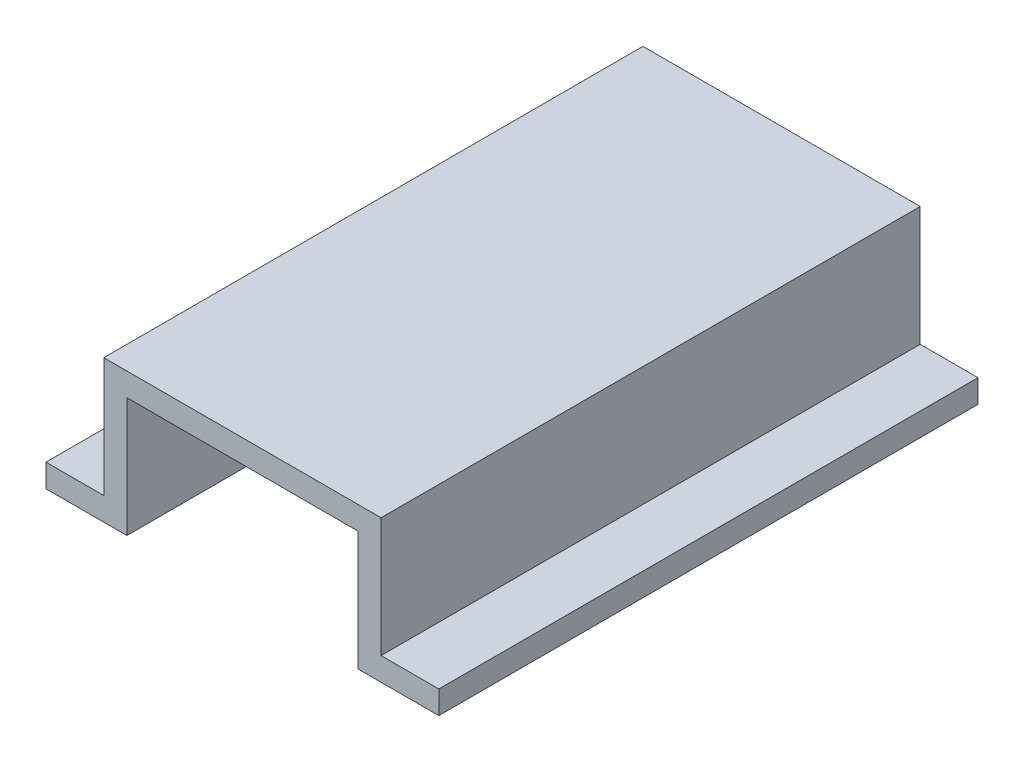
ISO-10303-21;
HEADER;
FILE_DESCRIPTION(('STEP AP214'),'2;1');
FILE_NAME('part.step','',(''),(''),'','','');
FILE_SCHEMA(('AUTOMOTIVE_DESIGN { 1 0 10303 214 1 1 1 1 }'));
ENDSEC;
DATA;
#1=APPLICATION_CONTEXT('core data for automotive mechanical design processes');
#2=APPLICATION_PROTOCOL_DEFINITION('international standard','automotive_design',2000,#1);
#3=PRODUCT_CONTEXT('',#1,'mechanical');
#4=PRODUCT('Part','Part','',(#3));
#5=PRODUCT_RELATED_PRODUCT_CATEGORY('part','',(#4));
#6=PRODUCT_DEFINITION_FORMATION('','',#4);
#7=PRODUCT_DEFINITION_CONTEXT('part definition',#1,'design');
#8=PRODUCT_DEFINITION('design','',#6,#7);
#9=PRODUCT_DEFINITION_SHAPE('','',#8);
#10=(LENGTH_UNIT() NAMED_UNIT(*) SI_UNIT(.MILLI.,.METRE.));
#11=(NAMED_UNIT(*) PLANE_ANGLE_UNIT() SI_UNIT($,.RADIAN.));
#12=(NAMED_UNIT(*) SI_UNIT($,.STERADIAN.) SOLID_ANGLE_UNIT());
#13=UNCERTAINTY_MEASURE_WITH_UNIT(LENGTH_MEASURE(1.E-05),#10,'distance_accuracy_value','');
#14=(GEOMETRIC_REPRESENTATION_CONTEXT(3) GLOBAL_UNCERTAINTY_ASSIGNED_CONTEXT((#13)) GLOBAL_UNIT_ASSIGNED_CONTEXT((#10,
#11,#12)) REPRESENTATION_CONTEXT('',''));
#15=CARTESIAN_POINT('',(0.,0.,0.));
#16=DIRECTION('',(0.,0.,1.));
#17=DIRECTION('',(1.,0.,0.));
#18=AXIS2_PLACEMENT_3D('',#15,#16,#17);
#19=CARTESIAN_POINT('',(0.,-6.,140.));
#20=DIRECTION('',(1.,0.,0.));
#21=DIRECTION('',(0.,0.,-1.));
#22=AXIS2_PLACEMENT_3D('',#19,#20,#21);
#23=PLANE('',#22);
#24=DIRECTION('',(0.,-1.,0.));
#25=VECTOR('',#24,1.);
#26=CARTESIAN_POINT('',(0.,-6.,0.));
#27=LINE('',#26,#25);
#28=CARTESIAN_POINT('',(0.,0.,0.));
#29=VERTEX_POINT('',#28);
#30=CARTESIAN_POINT('',(0.,-6.,0.));
#31=VERTEX_POINT('',#30);
#32=EDGE_CURVE('E156',#29,#31,#27,.T.);
#33=ORIENTED_EDGE('',*,*,#32,.T.);
#34=DIRECTION('',(0.,0.,-1.));
#35=VECTOR('',#34,1.);
#36=CARTESIAN_POINT('',(0.,-6.,140.));
#37=LINE('',#36,#35);
#38=CARTESIAN_POINT('',(0.,-6.,140.));
#39=VERTEX_POINT('',#38);
#40=EDGE_CURVE('E11',#39,#31,#37,.T.);
#41=ORIENTED_EDGE('',*,*,#40,.F.);
#42=DIRECTION('',(0.,-1.,0.));
#43=VECTOR('',#42,1.);
#44=CARTESIAN_POINT('',(0.,-6.,140.));
#45=LINE('',#44,#43);
#46=CARTESIAN_POINT('',(0.,0.,140.));
#47=VERTEX_POINT('',#46);
#48=EDGE_CURVE('E178',#47,#39,#45,.T.);
#49=ORIENTED_EDGE('',*,*,#48,.F.);
#50=DIRECTION('',(0.,0.,-1.));
#51=VECTOR('',#50,1.);
#52=CARTESIAN_POINT('',(0.,0.,140.));
#53=LINE('',#52,#51);
#54=EDGE_CURVE('E152',#47,#29,#53,.T.);
#55=ORIENTED_EDGE('',*,*,#54,.T.);
#56=EDGE_LOOP('',(#33,#41,#49,#55));
#57=FACE_BOUND('',#56,.T.);
#58=ADVANCED_FACE('F36',(#57),#23,.F.);
#59=CARTESIAN_POINT('',(21.,-6.,140.));
#60=DIRECTION('',(0.,1.,0.));
#61=DIRECTION('',(-1.,0.,0.));
#62=AXIS2_PLACEMENT_3D('',#59,#60,#61);
#63=PLANE('',#62);
#64=DIRECTION('',(1.,0.,0.));
#65=VECTOR('',#64,1.);
#66=CARTESIAN_POINT('',(21.,-6.,0.));
#67=LINE('',#66,#65);
#68=CARTESIAN_POINT('',(21.,-6.,0.));
#69=VERTEX_POINT('',#68);
#70=EDGE_CURVE('E159',#31,#69,#67,.T.);
#71=ORIENTED_EDGE('',*,*,#70,.T.);
#72=DIRECTION('',(0.,0.,-1.));
#73=VECTOR('',#72,1.);
#74=CARTESIAN_POINT('',(21.,-6.,140.));
#75=LINE('',#74,#73);
#76=CARTESIAN_POINT('',(21.,-6.,140.));
#77=VERTEX_POINT('',#76);
#78=EDGE_CURVE('E44',#77,#69,#75,.T.);
#79=ORIENTED_EDGE('',*,*,#78,.F.);
#80=DIRECTION('',(1.,0.,0.));
#81=VECTOR('',#80,1.);
#82=CARTESIAN_POINT('',(21.,-6.,140.));
#83=LINE('',#82,#81);
#84=EDGE_CURVE('E107',#39,#77,#83,.T.);
#85=ORIENTED_EDGE('',*,*,#84,.F.);
#86=ORIENTED_EDGE('',*,*,#40,.T.);
#87=EDGE_LOOP('',(#71,#79,#85,#86));
#88=FACE_BOUND('',#87,.T.);
#89=ADVANCED_FACE('F256',(#88),#63,.F.);
#90=CARTESIAN_POINT('',(21.,25.,140.));
#91=DIRECTION('',(-1.,0.,0.));
#92=DIRECTION('',(0.,-1.,0.));
#93=AXIS2_PLACEMENT_3D('',#90,#91,#92);
#94=PLANE('',#93);
#95=DIRECTION('',(0.,1.,0.));
#96=VECTOR('',#95,1.);
#97=CARTESIAN_POINT('',(21.,25.,0.));
#98=LINE('',#97,#96);
#99=CARTESIAN_POINT('',(21.,25.,0.));
#100=VERTEX_POINT('',#99);
#101=EDGE_CURVE('E161',#69,#100,#98,.T.);
#102=ORIENTED_EDGE('',*,*,#101,.T.);
#103=DIRECTION('',(0.,0.,-1.));
#104=VECTOR('',#103,1.);
#105=CARTESIAN_POINT('',(21.,25.,140.));
#106=LINE('',#105,#104);
#107=CARTESIAN_POINT('',(21.,25.,140.));
#108=VERTEX_POINT('',#107);
#109=EDGE_CURVE('E197',#108,#100,#106,.T.);
#110=ORIENTED_EDGE('',*,*,#109,.F.);
#111=DIRECTION('',(0.,1.,0.));
#112=VECTOR('',#111,1.);
#113=CARTESIAN_POINT('',(21.,25.,140.));
#114=LINE('',#113,#112);
#115=EDGE_CURVE('E205',#77,#108,#114,.T.);
#116=ORIENTED_EDGE('',*,*,#115,.F.);
#117=ORIENTED_EDGE('',*,*,#78,.T.);
#118=EDGE_LOOP('',(#102,#110,#116,#117));
#119=FACE_BOUND('',#118,.T.);
#120=ADVANCED_FACE('F203',(#119),#94,.F.);
#121=CARTESIAN_POINT('',(81.,25.,140.));
#122=DIRECTION('',(0.,1.,0.));
#123=DIRECTION('',(-1.,0.,0.));
#124=AXIS2_PLACEMENT_3D('',#121,#122,#123);
#125=PLANE('',#124);
#126=DIRECTION('',(1.,0.,0.));
#127=VECTOR('',#126,1.);
#128=CARTESIAN_POINT('',(81.,25.,0.));
#129=LINE('',#128,#127);
#130=CARTESIAN_POINT('',(81.,25.,0.));
#131=VERTEX_POINT('',#130);
#132=EDGE_CURVE('E163',#100,#131,#129,.T.);
#133=ORIENTED_EDGE('',*,*,#132,.T.);
#134=DIRECTION('',(0.,0.,-1.));
#135=VECTOR('',#134,1.);
#136=CARTESIAN_POINT('',(81.,25.,140.));
#137=LINE('',#136,#135);
#138=CARTESIAN_POINT('',(81.,25.,140.));
#139=VERTEX_POINT('',#138);
#140=EDGE_CURVE('E194',#139,#131,#137,.T.);
#141=ORIENTED_EDGE('',*,*,#140,.F.);
#142=DIRECTION('',(1.,0.,0.));
#143=VECTOR('',#142,1.);
#144=CARTESIAN_POINT('',(81.,25.,140.));
#145=LINE('',#144,#143);
#146=EDGE_CURVE('E223',#108,#139,#145,.T.);
#147=ORIENTED_EDGE('',*,*,#146,.F.);
#148=ORIENTED_EDGE('',*,*,#109,.T.);
#149=EDGE_LOOP('',(#133,#141,#147,#148));
#150=FACE_BOUND('',#149,.T.);
#151=ADVANCED_FACE('F214',(#150),#125,.F.);
#152=CARTESIAN_POINT('',(81.,-6.,140.));
#153=DIRECTION('',(1.,0.,0.));
#154=DIRECTION('',(0.,1.,0.));
#155=AXIS2_PLACEMENT_3D('',#152,#153,#154);
#156=PLANE('',#155);
#157=DIRECTION('',(0.,-1.,0.));
#158=VECTOR('',#157,1.);
#159=CARTESIAN_POINT('',(81.,-6.,0.));
#160=LINE('',#159,#158);
#161=CARTESIAN_POINT('',(81.,-6.,0.));
#162=VERTEX_POINT('',#161);
#163=EDGE_CURVE('E165',#131,#162,#160,.T.);
#164=ORIENTED_EDGE('',*,*,#163,.T.);
#165=DIRECTION('',(0.,0.,-1.));
#166=VECTOR('',#165,1.);
#167=CARTESIAN_POINT('',(81.,-6.,140.));
#168=LINE('',#167,#166);
#169=CARTESIAN_POINT('',(81.,-6.,140.));
#170=VERTEX_POINT('',#169);
#171=EDGE_CURVE('E191',#170,#162,#168,.T.);
#172=ORIENTED_EDGE('',*,*,#171,.F.);
#173=DIRECTION('',(0.,-1.,0.));
#174=VECTOR('',#173,1.);
#175=CARTESIAN_POINT('',(81.,-6.,140.));
#176=LINE('',#175,#174);
#177=EDGE_CURVE('E220',#139,#170,#176,.T.);
#178=ORIENTED_EDGE('',*,*,#177,.F.);
#179=ORIENTED_EDGE('',*,*,#140,.T.);
#180=EDGE_LOOP('',(#164,#172,#178,#179));
#181=FACE_BOUND('',#180,.T.);
#182=ADVANCED_FACE('F218',(#181),#156,.F.);
#183=CARTESIAN_POINT('',(102.,-6.,140.));
#184=DIRECTION('',(0.,1.,0.));
#185=DIRECTION('',(-1.,0.,0.));
#186=AXIS2_PLACEMENT_3D('',#183,#184,#185);
#187=PLANE('',#186);
#188=DIRECTION('',(1.,0.,0.));
#189=VECTOR('',#188,1.);
#190=CARTESIAN_POINT('',(102.,-6.,0.));
#191=LINE('',#190,#189);
#192=CARTESIAN_POINT('',(102.,-6.,0.));
#193=VERTEX_POINT('',#192);
#194=EDGE_CURVE('E167',#162,#193,#191,.T.);
#195=ORIENTED_EDGE('',*,*,#194,.T.);
#196=DIRECTION('',(0.,0.,-1.));
#197=VECTOR('',#196,1.);
#198=CARTESIAN_POINT('',(102.,-6.,140.));
#199=LINE('',#198,#197);
#200=CARTESIAN_POINT('',(102.,-6.,140.));
#201=VERTEX_POINT('',#200);
#202=EDGE_CURVE('E188',#201,#193,#199,.T.);
#203=ORIENTED_EDGE('',*,*,#202,.F.);
#204=DIRECTION('',(1.,0.,0.));
#205=VECTOR('',#204,1.);
#206=CARTESIAN_POINT('',(102.,-6.,140.));
#207=LINE('',#206,#205);
#208=EDGE_CURVE('E222',#170,#201,#207,.T.);
#209=ORIENTED_EDGE('',*,*,#208,.F.);
#210=ORIENTED_EDGE('',*,*,#171,.T.);
#211=EDGE_LOOP('',(#195,#203,#209,#210));
#212=FACE_BOUND('',#211,.T.);
#213=ADVANCED_FACE('F269',(#212),#187,.F.);
#214=CARTESIAN_POINT('',(102.,0.,140.));
#215=DIRECTION('',(-1.,0.,0.));
#216=DIRECTION('',(0.,0.,1.));
#217=AXIS2_PLACEMENT_3D('',#214,#215,#216);
#218=PLANE('',#217);
#219=DIRECTION('',(0.,1.,0.));
#220=VECTOR('',#219,1.);
#221=CARTESIAN_POINT('',(102.,0.,0.));
#222=LINE('',#221,#220);
#223=CARTESIAN_POINT('',(102.,0.,0.));
#224=VERTEX_POINT('',#223);
#225=EDGE_CURVE('E169',#193,#224,#222,.T.);
#226=ORIENTED_EDGE('',*,*,#225,.T.);
#227=DIRECTION('',(0.,0.,-1.));
#228=VECTOR('',#227,1.);
#229=CARTESIAN_POINT('',(102.,0.,140.));
#230=LINE('',#229,#228);
#231=CARTESIAN_POINT('',(102.,0.,140.));
#232=VERTEX_POINT('',#231);
#233=EDGE_CURVE('E185',#232,#224,#230,.T.);
#234=ORIENTED_EDGE('',*,*,#233,.F.);
#235=DIRECTION('',(0.,1.,0.));
#236=VECTOR('',#235,1.);
#237=CARTESIAN_POINT('',(102.,0.,140.));
#238=LINE('',#237,#236);
#239=EDGE_CURVE('E225',#201,#232,#238,.T.);
#240=ORIENTED_EDGE('',*,*,#239,.F.);
#241=ORIENTED_EDGE('',*,*,#202,.T.);
#242=EDGE_LOOP('',(#226,#234,#240,#241));
#243=FACE_BOUND('',#242,.T.);
#244=ADVANCED_FACE('F272',(#243),#218,.F.);
#245=CARTESIAN_POINT('',(87.,0.,140.));
#246=DIRECTION('',(0.,-1.,0.));
#247=DIRECTION('',(1.,0.,0.));
#248=AXIS2_PLACEMENT_3D('',#245,#246,#247);
#249=PLANE('',#248);
#250=DIRECTION('',(-1.,0.,0.));
#251=VECTOR('',#250,1.);
#252=CARTESIAN_POINT('',(87.,0.,0.));
#253=LINE('',#252,#251);
#254=CARTESIAN_POINT('',(87.,0.,0.));
#255=VERTEX_POINT('',#254);
#256=EDGE_CURVE('E171',#224,#255,#253,.T.);
#257=ORIENTED_EDGE('',*,*,#256,.T.);
#258=DIRECTION('',(0.,0.,-1.));
#259=VECTOR('',#258,1.);
#260=CARTESIAN_POINT('',(87.,0.,140.));
#261=LINE('',#260,#259);
#262=CARTESIAN_POINT('',(87.,0.,140.));
#263=VERTEX_POINT('',#262);
#264=EDGE_CURVE('E182',#263,#255,#261,.T.);
#265=ORIENTED_EDGE('',*,*,#264,.F.);
#266=DIRECTION('',(-1.,0.,0.));
#267=VECTOR('',#266,1.);
#268=CARTESIAN_POINT('',(87.,0.,140.));
#269=LINE('',#268,#267);
#270=EDGE_CURVE('E231',#232,#263,#269,.T.);
#271=ORIENTED_EDGE('',*,*,#270,.F.);
#272=ORIENTED_EDGE('',*,*,#233,.T.);
#273=EDGE_LOOP('',(#257,#265,#271,#272));
#274=FACE_BOUND('',#273,.T.);
#275=ADVANCED_FACE('F237',(#274),#249,.F.);
#276=CARTESIAN_POINT('',(87.,31.,140.));
#277=DIRECTION('',(-1.,0.,0.));
#278=DIRECTION('',(0.,0.,1.));
#279=AXIS2_PLACEMENT_3D('',#276,#277,#278);
#280=PLANE('',#279);
#281=DIRECTION('',(0.,1.,0.));
#282=VECTOR('',#281,1.);
#283=CARTESIAN_POINT('',(87.,31.,0.));
#284=LINE('',#283,#282);
#285=CARTESIAN_POINT('',(87.,31.,0.));
#286=VERTEX_POINT('',#285);
#287=EDGE_CURVE('E173',#255,#286,#284,.T.);
#288=ORIENTED_EDGE('',*,*,#287,.T.);
#289=DIRECTION('',(0.,0.,-1.));
#290=VECTOR('',#289,1.);
#291=CARTESIAN_POINT('',(87.,31.,140.));
#292=LINE('',#291,#290);
#293=CARTESIAN_POINT('',(87.,31.,140.));
#294=VERTEX_POINT('',#293);
#295=EDGE_CURVE('E147',#294,#286,#292,.T.);
#296=ORIENTED_EDGE('',*,*,#295,.F.);
#297=DIRECTION('',(0.,1.,0.));
#298=VECTOR('',#297,1.);
#299=CARTESIAN_POINT('',(87.,31.,140.));
#300=LINE('',#299,#298);
#301=EDGE_CURVE('E138',#263,#294,#300,.T.);
#302=ORIENTED_EDGE('',*,*,#301,.F.);
#303=ORIENTED_EDGE('',*,*,#264,.T.);
#304=EDGE_LOOP('',(#288,#296,#302,#303));
#305=FACE_BOUND('',#304,.T.);
#306=ADVANCED_FACE('F241',(#305),#280,.F.);
#307=CARTESIAN_POINT('',(15.,31.,140.));
#308=DIRECTION('',(0.,-1.,0.));
#309=DIRECTION('',(0.,0.,-1.));
#310=AXIS2_PLACEMENT_3D('',#307,#308,#309);
#311=PLANE('',#310);
#312=DIRECTION('',(-1.,0.,0.));
#313=VECTOR('',#312,1.);
#314=CARTESIAN_POINT('',(15.,31.,0.));
#315=LINE('',#314,#313);
#316=CARTESIAN_POINT('',(15.,31.,0.));
#317=VERTEX_POINT('',#316);
#318=EDGE_CURVE('E146',#286,#317,#315,.T.);
#319=ORIENTED_EDGE('',*,*,#318,.T.);
#320=DIRECTION('',(0.,0.,-1.));
#321=VECTOR('',#320,1.);
#322=CARTESIAN_POINT('',(15.,31.,140.));
#323=LINE('',#322,#321);
#324=CARTESIAN_POINT('',(15.,31.,140.));
#325=VERTEX_POINT('',#324);
#326=EDGE_CURVE('E143',#325,#317,#323,.T.);
#327=ORIENTED_EDGE('',*,*,#326,.F.);
#328=DIRECTION('',(-1.,0.,0.));
#329=VECTOR('',#328,1.);
#330=CARTESIAN_POINT('',(15.,31.,140.));
#331=LINE('',#330,#329);
#332=EDGE_CURVE('E132',#294,#325,#331,.T.);
#333=ORIENTED_EDGE('',*,*,#332,.F.);
#334=ORIENTED_EDGE('',*,*,#295,.T.);
#335=EDGE_LOOP('',(#319,#327,#333,#334));
#336=FACE_BOUND('',#335,.T.);
#337=ADVANCED_FACE('F144',(#336),#311,.F.);
#338=CARTESIAN_POINT('',(15.,0.,140.));
#339=DIRECTION('',(1.,0.,0.));
#340=DIRECTION('',(0.,0.,-1.));
#341=AXIS2_PLACEMENT_3D('',#338,#339,#340);
#342=PLANE('',#341);
#343=DIRECTION('',(0.,-1.,0.));
#344=VECTOR('',#343,1.);
#345=CARTESIAN_POINT('',(15.,0.,0.));
#346=LINE('',#345,#344);
#347=CARTESIAN_POINT('',(15.,0.,0.));
#348=VERTEX_POINT('',#347);
#349=EDGE_CURVE('E93',#317,#348,#346,.T.);
#350=ORIENTED_EDGE('',*,*,#349,.T.);
#351=DIRECTION('',(0.,0.,-1.));
#352=VECTOR('',#351,1.);
#353=CARTESIAN_POINT('',(15.,0.,140.));
#354=LINE('',#353,#352);
#355=CARTESIAN_POINT('',(15.,0.,140.));
#356=VERTEX_POINT('',#355);
#357=EDGE_CURVE('E148',#356,#348,#354,.T.);
#358=ORIENTED_EDGE('',*,*,#357,.F.);
#359=DIRECTION('',(0.,-1.,0.));
#360=VECTOR('',#359,1.);
#361=CARTESIAN_POINT('',(15.,0.,140.));
#362=LINE('',#361,#360);
#363=EDGE_CURVE('E136',#325,#356,#362,.T.);
#364=ORIENTED_EDGE('',*,*,#363,.F.);
#365=ORIENTED_EDGE('',*,*,#326,.T.);
#366=EDGE_LOOP('',(#350,#358,#364,#365));
#367=FACE_BOUND('',#366,.T.);
#368=ADVANCED_FACE('F150',(#367),#342,.F.);
#369=CARTESIAN_POINT('',(0.,0.,140.));
#370=DIRECTION('',(0.,-1.,0.));
#371=DIRECTION('',(0.,0.,-1.));
#372=AXIS2_PLACEMENT_3D('',#369,#370,#371);
#373=PLANE('',#372);
#374=DIRECTION('',(-1.,0.,0.));
#375=VECTOR('',#374,1.);
#376=CARTESIAN_POINT('',(0.,0.,0.));
#377=LINE('',#376,#375);
#378=EDGE_CURVE('E99',#348,#29,#377,.T.);
#379=ORIENTED_EDGE('',*,*,#378,.T.);
#380=ORIENTED_EDGE('',*,*,#54,.F.);
#381=DIRECTION('',(-1.,0.,0.));
#382=VECTOR('',#381,1.);
#383=CARTESIAN_POINT('',(0.,0.,140.));
#384=LINE('',#383,#382);
#385=EDGE_CURVE('E52',#356,#47,#384,.T.);
#386=ORIENTED_EDGE('',*,*,#385,.F.);
#387=ORIENTED_EDGE('',*,*,#357,.T.);
#388=EDGE_LOOP('',(#379,#380,#386,#387));
#389=FACE_BOUND('',#388,.T.);
#390=ADVANCED_FACE('F245',(#389),#373,.F.);
#391=CARTESIAN_POINT('',(0.,0.,140.));
#392=DIRECTION('',(0.,0.,-1.));
#393=DIRECTION('',(-1.,0.,0.));
#394=AXIS2_PLACEMENT_3D('',#391,#392,#393);
#395=PLANE('',#394);
#396=ORIENTED_EDGE('',*,*,#48,.T.);
#397=ORIENTED_EDGE('',*,*,#84,.T.);
#398=ORIENTED_EDGE('',*,*,#115,.T.);
#399=ORIENTED_EDGE('',*,*,#146,.T.);
#400=ORIENTED_EDGE('',*,*,#177,.T.);
#401=ORIENTED_EDGE('',*,*,#208,.T.);
#402=ORIENTED_EDGE('',*,*,#239,.T.);
#403=ORIENTED_EDGE('',*,*,#270,.T.);
#404=ORIENTED_EDGE('',*,*,#301,.T.);
#405=ORIENTED_EDGE('',*,*,#332,.T.);
#406=ORIENTED_EDGE('',*,*,#363,.T.);
#407=ORIENTED_EDGE('',*,*,#385,.T.);
#408=EDGE_LOOP('',(#396,#397,#398,#399,#400,#401,#402,#403,#404,#405,#406,#407));
#409=FACE_BOUND('',#408,.T.);
#410=ADVANCED_FACE('F134',(#409),#395,.F.);
#411=CARTESIAN_POINT('',(0.,0.,0.));
#412=DIRECTION('',(0.,0.,-1.));
#413=DIRECTION('',(-1.,0.,0.));
#414=AXIS2_PLACEMENT_3D('',#411,#412,#413);
#415=PLANE('',#414);
#416=ORIENTED_EDGE('',*,*,#32,.F.);
#417=ORIENTED_EDGE('',*,*,#378,.F.);
#418=ORIENTED_EDGE('',*,*,#349,.F.);
#419=ORIENTED_EDGE('',*,*,#318,.F.);
#420=ORIENTED_EDGE('',*,*,#287,.F.);
#421=ORIENTED_EDGE('',*,*,#256,.F.);
#422=ORIENTED_EDGE('',*,*,#225,.F.);
#423=ORIENTED_EDGE('',*,*,#194,.F.);
#424=ORIENTED_EDGE('',*,*,#163,.F.);
#425=ORIENTED_EDGE('',*,*,#132,.F.);
#426=ORIENTED_EDGE('',*,*,#101,.F.);
#427=ORIENTED_EDGE('',*,*,#70,.F.);
#428=EDGE_LOOP('',(#416,#417,#418,#419,#420,#421,#422,#423,#424,#425,#426,#427));
#429=FACE_BOUND('',#428,.T.);
#430=ADVANCED_FACE('F209',(#429),#415,.T.);
#431=CLOSED_SHELL('',(#58,#89,#120,#151,#182,#213,#244,#275,#306,#337,#368,#390,#410,#430));
#432=MANIFOLD_SOLID_BREP('B2',#431);
#433=ADVANCED_BREP_SHAPE_REPRESENTATION('',(#18,#432),#14);
#434=SHAPE_DEFINITION_REPRESENTATION(#9,#433);
ENDSEC;
END-ISO-10303-21;
